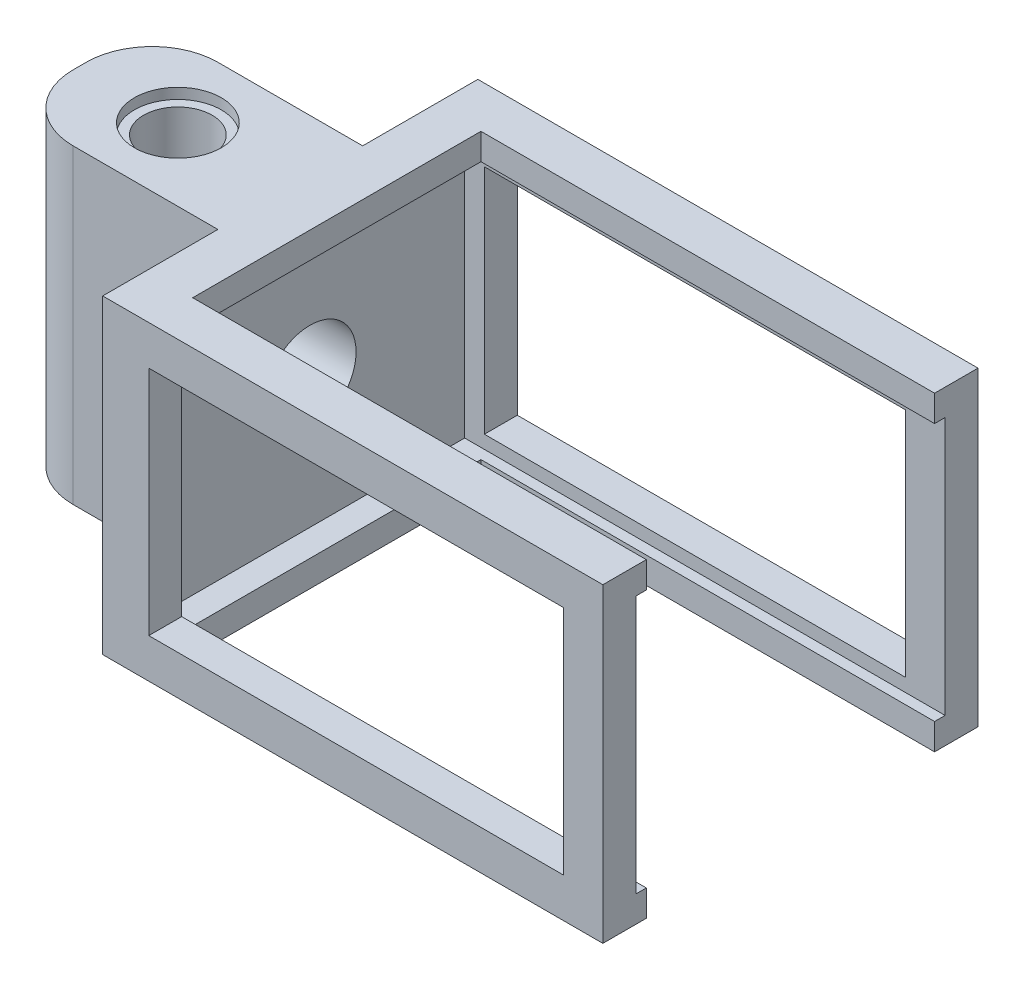
ISO-10303-21;
HEADER;
FILE_DESCRIPTION(('STEP AP214'),'2;1');
FILE_NAME('part.step','',(''),(''),'','','');
FILE_SCHEMA(('AUTOMOTIVE_DESIGN { 1 0 10303 214 1 1 1 1 }'));
ENDSEC;
DATA;
#1=APPLICATION_CONTEXT('core data for automotive mechanical design processes');
#2=APPLICATION_PROTOCOL_DEFINITION('international standard','automotive_design',2000,#1);
#3=PRODUCT_CONTEXT('',#1,'mechanical');
#4=PRODUCT('Part','Part','',(#3));
#5=PRODUCT_RELATED_PRODUCT_CATEGORY('part','',(#4));
#6=PRODUCT_DEFINITION_FORMATION('','',#4);
#7=PRODUCT_DEFINITION_CONTEXT('part definition',#1,'design');
#8=PRODUCT_DEFINITION('design','',#6,#7);
#9=PRODUCT_DEFINITION_SHAPE('','',#8);
#10=(LENGTH_UNIT() NAMED_UNIT(*) SI_UNIT(.MILLI.,.METRE.));
#11=(NAMED_UNIT(*) PLANE_ANGLE_UNIT() SI_UNIT($,.RADIAN.));
#12=(NAMED_UNIT(*) SI_UNIT($,.STERADIAN.) SOLID_ANGLE_UNIT());
#13=UNCERTAINTY_MEASURE_WITH_UNIT(LENGTH_MEASURE(1.E-05),#10,'distance_accuracy_value','');
#14=(GEOMETRIC_REPRESENTATION_CONTEXT(3) GLOBAL_UNCERTAINTY_ASSIGNED_CONTEXT((#13)) GLOBAL_UNIT_ASSIGNED_CONTEXT((#10,
#11,#12)) REPRESENTATION_CONTEXT('',''));
#15=CARTESIAN_POINT('',(0.,0.,0.));
#16=DIRECTION('',(0.,0.,1.));
#17=DIRECTION('',(1.,0.,0.));
#18=AXIS2_PLACEMENT_3D('',#15,#16,#17);
#19=CARTESIAN_POINT('',(0.,0.,2.5));
#20=DIRECTION('',(0.,0.,-1.));
#21=DIRECTION('',(-1.,0.,0.));
#22=AXIS2_PLACEMENT_3D('',#19,#20,#21);
#23=PLANE('',#22);
#24=DIRECTION('',(-1.,0.,0.));
#25=VECTOR('',#24,1.);
#26=CARTESIAN_POINT('',(38.,20.6,2.5));
#27=LINE('',#26,#25);
#28=CARTESIAN_POINT('',(35.,20.6,2.5));
#29=VERTEX_POINT('',#28);
#30=CARTESIAN_POINT('',(3.,20.6,2.5));
#31=VERTEX_POINT('',#30);
#32=EDGE_CURVE('E416',#29,#31,#27,.T.);
#33=ORIENTED_EDGE('',*,*,#32,.F.);
#34=DIRECTION('',(0.,-1.,0.));
#35=VECTOR('',#34,1.);
#36=CARTESIAN_POINT('',(35.,23.,2.5));
#37=LINE('',#36,#35);
#38=CARTESIAN_POINT('',(35.,3.,2.5));
#39=VERTEX_POINT('',#38);
#40=EDGE_CURVE('E353',#29,#39,#37,.T.);
#41=ORIENTED_EDGE('',*,*,#40,.T.);
#42=DIRECTION('',(1.,0.,0.));
#43=VECTOR('',#42,1.);
#44=CARTESIAN_POINT('',(38.,3.,2.5));
#45=LINE('',#44,#43);
#46=CARTESIAN_POINT('',(3.,3.,2.5));
#47=VERTEX_POINT('',#46);
#48=EDGE_CURVE('E420',#47,#39,#45,.T.);
#49=ORIENTED_EDGE('',*,*,#48,.F.);
#50=DIRECTION('',(0.,-1.,0.));
#51=VECTOR('',#50,1.);
#52=CARTESIAN_POINT('',(3.,20.6,2.5));
#53=LINE('',#52,#51);
#54=EDGE_CURVE('E428',#31,#47,#53,.T.);
#55=ORIENTED_EDGE('',*,*,#54,.F.);
#56=EDGE_LOOP('',(#33,#41,#49,#55));
#57=FACE_BOUND('',#56,.T.);
#58=DIRECTION('',(-1.,0.,0.));
#59=VECTOR('',#58,1.);
#60=CARTESIAN_POINT('',(0.,2.,2.5));
#61=LINE('',#60,#59);
#62=CARTESIAN_POINT('',(38.,2.,2.5));
#63=VERTEX_POINT('',#62);
#64=CARTESIAN_POINT('',(1.5,2.,2.5));
#65=VERTEX_POINT('',#64);
#66=EDGE_CURVE('E52',#63,#65,#61,.T.);
#67=ORIENTED_EDGE('',*,*,#66,.F.);
#68=DIRECTION('',(0.,1.,0.));
#69=VECTOR('',#68,1.);
#70=CARTESIAN_POINT('',(38.,0.,2.5));
#71=LINE('',#70,#69);
#72=CARTESIAN_POINT('',(38.,21.6,2.5));
#73=VERTEX_POINT('',#72);
#74=EDGE_CURVE('E437',#63,#73,#71,.T.);
#75=ORIENTED_EDGE('',*,*,#74,.T.);
#76=DIRECTION('',(1.,0.,0.));
#77=VECTOR('',#76,1.);
#78=CARTESIAN_POINT('',(0.,21.6,2.5));
#79=LINE('',#78,#77);
#80=CARTESIAN_POINT('',(1.5,21.6,2.5));
#81=VERTEX_POINT('',#80);
#82=EDGE_CURVE('E397',#81,#73,#79,.T.);
#83=ORIENTED_EDGE('',*,*,#82,.F.);
#84=DIRECTION('',(0.,1.,0.));
#85=VECTOR('',#84,1.);
#86=CARTESIAN_POINT('',(1.5,0.,2.5));
#87=LINE('',#86,#85);
#88=EDGE_CURVE('E407',#65,#81,#87,.T.);
#89=ORIENTED_EDGE('',*,*,#88,.F.);
#90=EDGE_LOOP('',(#67,#75,#83,#89));
#91=FACE_BOUND('',#90,.T.);
#92=ADVANCED_FACE('F37',(#57,#91),#23,.F.);
#93=CARTESIAN_POINT('',(3.53721509060322,-6.4,0.));
#94=DIRECTION('',(-1.,0.,0.));
#95=DIRECTION('',(0.,0.,1.));
#96=AXIS2_PLACEMENT_3D('',#93,#94,#95);
#97=PLANE('',#96);
#98=DIRECTION('',(0.,-1.,0.));
#99=VECTOR('',#98,1.);
#100=CARTESIAN_POINT('',(3.53721509060322,0.,3.3));
#101=LINE('',#100,#99);
#102=CARTESIAN_POINT('',(3.53721509060322,2.,3.3));
#103=VERTEX_POINT('',#102);
#104=CARTESIAN_POINT('',(3.53721509060322,0.,3.3));
#105=VERTEX_POINT('',#104);
#106=EDGE_CURVE('E60',#103,#105,#101,.T.);
#107=ORIENTED_EDGE('',*,*,#106,.F.);
#108=DIRECTION('',(0.,0.,-1.));
#109=VECTOR('',#108,1.);
#110=CARTESIAN_POINT('',(3.53721509060322,2.,28.5));
#111=LINE('',#110,#109);
#112=CARTESIAN_POINT('',(3.53721509060322,2.,25.2));
#113=VERTEX_POINT('',#112);
#114=EDGE_CURVE('E240',#113,#103,#111,.T.);
#115=ORIENTED_EDGE('',*,*,#114,.F.);
#116=DIRECTION('',(0.,1.,0.));
#117=VECTOR('',#116,1.);
#118=CARTESIAN_POINT('',(3.53721509060322,0.,25.2));
#119=LINE('',#118,#117);
#120=CARTESIAN_POINT('',(3.53721509060322,0.,25.2));
#121=VERTEX_POINT('',#120);
#122=EDGE_CURVE('E236',#121,#113,#119,.T.);
#123=ORIENTED_EDGE('',*,*,#122,.F.);
#124=DIRECTION('',(0.,0.,1.));
#125=VECTOR('',#124,1.);
#126=CARTESIAN_POINT('',(3.53721509060322,0.,2.5));
#127=LINE('',#126,#125);
#128=EDGE_CURVE('E232',#105,#121,#127,.T.);
#129=ORIENTED_EDGE('',*,*,#128,.F.);
#130=EDGE_LOOP('',(#107,#115,#123,#129));
#131=FACE_BOUND('',#130,.T.);
#132=ADVANCED_FACE('F234',(#131),#97,.F.);
#133=CARTESIAN_POINT('',(38.,3.,26.));
#134=DIRECTION('',(0.,0.,1.));
#135=DIRECTION('',(1.,0.,0.));
#136=AXIS2_PLACEMENT_3D('',#133,#134,#135);
#137=PLANE('',#136);
#138=DIRECTION('',(0.,-1.,0.));
#139=VECTOR('',#138,1.);
#140=CARTESIAN_POINT('',(35.,23.,26.));
#141=LINE('',#140,#139);
#142=CARTESIAN_POINT('',(35.,20.6,26.));
#143=VERTEX_POINT('',#142);
#144=CARTESIAN_POINT('',(35.,3.,26.));
#145=VERTEX_POINT('',#144);
#146=EDGE_CURVE('E347',#143,#145,#141,.T.);
#147=ORIENTED_EDGE('',*,*,#146,.F.);
#148=DIRECTION('',(1.,0.,0.));
#149=VECTOR('',#148,1.);
#150=CARTESIAN_POINT('',(0.,20.6,26.));
#151=LINE('',#150,#149);
#152=CARTESIAN_POINT('',(3.5,20.6,26.));
#153=VERTEX_POINT('',#152);
#154=EDGE_CURVE('E378',#153,#143,#151,.T.);
#155=ORIENTED_EDGE('',*,*,#154,.F.);
#156=DIRECTION('',(0.,1.,0.));
#157=VECTOR('',#156,1.);
#158=CARTESIAN_POINT('',(3.5,3.,26.));
#159=LINE('',#158,#157);
#160=CARTESIAN_POINT('',(3.5,3.,26.));
#161=VERTEX_POINT('',#160);
#162=EDGE_CURVE('E363',#161,#153,#159,.T.);
#163=ORIENTED_EDGE('',*,*,#162,.F.);
#164=DIRECTION('',(-1.,0.,0.));
#165=VECTOR('',#164,1.);
#166=CARTESIAN_POINT('',(38.,3.,26.));
#167=LINE('',#166,#165);
#168=EDGE_CURVE('E382',#145,#161,#167,.T.);
#169=ORIENTED_EDGE('',*,*,#168,.F.);
#170=EDGE_LOOP('',(#147,#155,#163,#169));
#171=FACE_BOUND('',#170,.T.);
#172=DIRECTION('',(0.,-1.,0.));
#173=VECTOR('',#172,1.);
#174=CARTESIAN_POINT('',(38.,3.,26.));
#175=LINE('',#174,#173);
#176=CARTESIAN_POINT('',(38.,21.6,26.));
#177=VERTEX_POINT('',#176);
#178=CARTESIAN_POINT('',(38.,2.,26.));
#179=VERTEX_POINT('',#178);
#180=EDGE_CURVE('E390',#177,#179,#175,.T.);
#181=ORIENTED_EDGE('',*,*,#180,.T.);
#182=DIRECTION('',(-1.,0.,0.));
#183=VECTOR('',#182,1.);
#184=CARTESIAN_POINT('',(38.,2.,26.));
#185=LINE('',#184,#183);
#186=CARTESIAN_POINT('',(1.5,2.,26.));
#187=VERTEX_POINT('',#186);
#188=EDGE_CURVE('E380',#179,#187,#185,.T.);
#189=ORIENTED_EDGE('',*,*,#188,.T.);
#190=DIRECTION('',(0.,-1.,0.));
#191=VECTOR('',#190,1.);
#192=CARTESIAN_POINT('',(1.5,3.,26.));
#193=LINE('',#192,#191);
#194=CARTESIAN_POINT('',(1.5,21.6,26.));
#195=VERTEX_POINT('',#194);
#196=EDGE_CURVE('E386',#195,#187,#193,.T.);
#197=ORIENTED_EDGE('',*,*,#196,.F.);
#198=DIRECTION('',(1.,0.,0.));
#199=VECTOR('',#198,1.);
#200=CARTESIAN_POINT('',(0.,21.6,26.));
#201=LINE('',#200,#199);
#202=EDGE_CURVE('E375',#195,#177,#201,.T.);
#203=ORIENTED_EDGE('',*,*,#202,.T.);
#204=EDGE_LOOP('',(#181,#189,#197,#203));
#205=FACE_BOUND('',#204,.T.);
#206=ADVANCED_FACE('F569',(#171,#205),#137,.F.);
#207=DIRECTION('',(0.,-1.,0.));
#208=VECTOR('',#207,1.);
#209=CARTESIAN_POINT('',(3.53721509060322,21.6,3.3));
#210=LINE('',#209,#208);
#211=CARTESIAN_POINT('',(3.53721509060322,23.6,3.3));
#212=VERTEX_POINT('',#211);
#213=CARTESIAN_POINT('',(3.53721509060322,21.6,3.3));
#214=VERTEX_POINT('',#213);
#215=EDGE_CURVE('E280',#212,#214,#210,.T.);
#216=ORIENTED_EDGE('',*,*,#215,.F.);
#217=DIRECTION('',(0.,0.,1.));
#218=VECTOR('',#217,1.);
#219=CARTESIAN_POINT('',(3.53721509060322,23.6,0.));
#220=LINE('',#219,#218);
#221=CARTESIAN_POINT('',(3.53721509060322,23.6,25.2));
#222=VERTEX_POINT('',#221);
#223=EDGE_CURVE('E241',#212,#222,#220,.T.);
#224=ORIENTED_EDGE('',*,*,#223,.T.);
#225=DIRECTION('',(0.,1.,0.));
#226=VECTOR('',#225,1.);
#227=CARTESIAN_POINT('',(3.53721509060322,21.6,25.2));
#228=LINE('',#227,#226);
#229=CARTESIAN_POINT('',(3.53721509060322,21.6,25.2));
#230=VERTEX_POINT('',#229);
#231=EDGE_CURVE('E294',#230,#222,#228,.T.);
#232=ORIENTED_EDGE('',*,*,#231,.F.);
#233=DIRECTION('',(0.,0.,1.));
#234=VECTOR('',#233,1.);
#235=CARTESIAN_POINT('',(3.53721509060322,21.6,28.5));
#236=LINE('',#235,#234);
#237=EDGE_CURVE('E361',#214,#230,#236,.T.);
#238=ORIENTED_EDGE('',*,*,#237,.F.);
#239=EDGE_LOOP('',(#216,#224,#232,#238));
#240=FACE_BOUND('',#239,.T.);
#241=ADVANCED_FACE('F527',(#240),#97,.F.);
#242=CARTESIAN_POINT('',(-8.54,-6.4,14.2500000000002));
#243=DIRECTION('',(0.,1.,0.));
#244=DIRECTION('',(0.,0.,1.));
#245=AXIS2_PLACEMENT_3D('',#242,#243,#244);
#246=CYLINDRICAL_SURFACE('',#245,2.6);
#247=CARTESIAN_POINT('',(-8.54,22.8,14.2500000000002));
#248=DIRECTION('',(0.,1.,0.));
#249=DIRECTION('',(0.,0.,1.));
#250=AXIS2_PLACEMENT_3D('',#247,#248,#249);
#251=CIRCLE('',#250,2.6);
#252=CARTESIAN_POINT('',(-8.54,22.8,16.8500000000002));
#253=VERTEX_POINT('',#252);
#254=EDGE_CURVE('E318',#253,#253,#251,.F.);
#255=ORIENTED_EDGE('',*,*,#254,.F.);
#256=EDGE_LOOP('',(#255));
#257=FACE_BOUND('',#256,.T.);
#258=CARTESIAN_POINT('',(-8.54,0.8,14.2500000000002));
#259=DIRECTION('',(0.,-1.,0.));
#260=DIRECTION('',(0.,0.,-1.));
#261=AXIS2_PLACEMENT_3D('',#258,#259,#260);
#262=CIRCLE('',#261,2.6);
#263=CARTESIAN_POINT('',(-8.54,0.8,11.6500000000002));
#264=VERTEX_POINT('',#263);
#265=EDGE_CURVE('E312',#264,#264,#262,.F.);
#266=ORIENTED_EDGE('',*,*,#265,.F.);
#267=EDGE_LOOP('',(#266));
#268=FACE_BOUND('',#267,.T.);
#269=ADVANCED_FACE('F614',(#257,#268),#246,.F.);
#270=CARTESIAN_POINT('',(0.,0.,2.5));
#271=DIRECTION('',(1.,0.,0.));
#272=DIRECTION('',(0.,0.,-1.));
#273=AXIS2_PLACEMENT_3D('',#270,#271,#272);
#274=PLANE('',#273);
#275=DIRECTION('',(0.,-1.,0.));
#276=VECTOR('',#275,1.);
#277=CARTESIAN_POINT('',(0.,0.,8.75));
#278=LINE('',#277,#276);
#279=CARTESIAN_POINT('',(0.,23.6,8.75));
#280=VERTEX_POINT('',#279);
#281=CARTESIAN_POINT('',(0.,0.,8.75));
#282=VERTEX_POINT('',#281);
#283=EDGE_CURVE('E325',#280,#282,#278,.T.);
#284=ORIENTED_EDGE('',*,*,#283,.F.);
#285=DIRECTION('',(0.,0.,-1.));
#286=VECTOR('',#285,1.);
#287=CARTESIAN_POINT('',(0.,23.6,2.5));
#288=LINE('',#287,#286);
#289=CARTESIAN_POINT('',(0.,23.6,0.));
#290=VERTEX_POINT('',#289);
#291=EDGE_CURVE('E439',#280,#290,#288,.T.);
#292=ORIENTED_EDGE('',*,*,#291,.T.);
#293=DIRECTION('',(0.,-1.,0.));
#294=VECTOR('',#293,1.);
#295=CARTESIAN_POINT('',(0.,0.,0.));
#296=LINE('',#295,#294);
#297=CARTESIAN_POINT('',(0.,0.,0.));
#298=VERTEX_POINT('',#297);
#299=EDGE_CURVE('E434',#290,#298,#296,.T.);
#300=ORIENTED_EDGE('',*,*,#299,.T.);
#301=DIRECTION('',(0.,0.,-1.));
#302=VECTOR('',#301,1.);
#303=CARTESIAN_POINT('',(0.,0.,2.5));
#304=LINE('',#303,#302);
#305=EDGE_CURVE('E457',#282,#298,#304,.T.);
#306=ORIENTED_EDGE('',*,*,#305,.F.);
#307=EDGE_LOOP('',(#284,#292,#300,#306));
#308=FACE_BOUND('',#307,.T.);
#309=ADVANCED_FACE('F546',(#308),#274,.F.);
#310=CARTESIAN_POINT('',(0.,3.,0.));
#311=DIRECTION('',(0.,1.,0.));
#312=DIRECTION('',(-1.,0.,0.));
#313=AXIS2_PLACEMENT_3D('',#310,#311,#312);
#314=PLANE('',#313);
#315=DIRECTION('',(1.,0.,0.));
#316=VECTOR('',#315,1.);
#317=CARTESIAN_POINT('',(38.,3.,28.5));
#318=LINE('',#317,#316);
#319=CARTESIAN_POINT('',(3.5,3.,28.5));
#320=VERTEX_POINT('',#319);
#321=CARTESIAN_POINT('',(35.,3.,28.5));
#322=VERTEX_POINT('',#321);
#323=EDGE_CURVE('E384',#320,#322,#318,.T.);
#324=ORIENTED_EDGE('',*,*,#323,.T.);
#325=DIRECTION('',(0.,0.,1.));
#326=VECTOR('',#325,1.);
#327=CARTESIAN_POINT('',(35.,3.,28.5));
#328=LINE('',#327,#326);
#329=EDGE_CURVE('E341',#145,#322,#328,.T.);
#330=ORIENTED_EDGE('',*,*,#329,.F.);
#331=ORIENTED_EDGE('',*,*,#168,.T.);
#332=DIRECTION('',(0.,0.,-1.));
#333=VECTOR('',#332,1.);
#334=CARTESIAN_POINT('',(3.5,3.,26.));
#335=LINE('',#334,#333);
#336=EDGE_CURVE('E372',#320,#161,#335,.T.);
#337=ORIENTED_EDGE('',*,*,#336,.F.);
#338=EDGE_LOOP('',(#324,#330,#331,#337));
#339=FACE_BOUND('',#338,.T.);
#340=ADVANCED_FACE('F621',(#339),#314,.T.);
#341=CARTESIAN_POINT('',(0.,20.6,0.));
#342=DIRECTION('',(0.,-1.,0.));
#343=DIRECTION('',(0.,0.,-1.));
#344=AXIS2_PLACEMENT_3D('',#341,#342,#343);
#345=PLANE('',#344);
#346=ORIENTED_EDGE('',*,*,#154,.T.);
#347=DIRECTION('',(0.,0.,1.));
#348=VECTOR('',#347,1.);
#349=CARTESIAN_POINT('',(35.,20.6,0.));
#350=LINE('',#349,#348);
#351=CARTESIAN_POINT('',(35.,20.6,28.5));
#352=VERTEX_POINT('',#351);
#353=EDGE_CURVE('E464',#143,#352,#350,.T.);
#354=ORIENTED_EDGE('',*,*,#353,.T.);
#355=DIRECTION('',(-1.,0.,0.));
#356=VECTOR('',#355,1.);
#357=CARTESIAN_POINT('',(0.,20.6,28.5));
#358=LINE('',#357,#356);
#359=CARTESIAN_POINT('',(3.5,20.6,28.5));
#360=VERTEX_POINT('',#359);
#361=EDGE_CURVE('E376',#352,#360,#358,.T.);
#362=ORIENTED_EDGE('',*,*,#361,.T.);
#363=DIRECTION('',(0.,0.,1.));
#364=VECTOR('',#363,1.);
#365=CARTESIAN_POINT('',(3.5,20.6,26.));
#366=LINE('',#365,#364);
#367=EDGE_CURVE('E366',#153,#360,#366,.T.);
#368=ORIENTED_EDGE('',*,*,#367,.F.);
#369=EDGE_LOOP('',(#346,#354,#362,#368));
#370=FACE_BOUND('',#369,.T.);
#371=ADVANCED_FACE('F640',(#370),#345,.T.);
#372=CARTESIAN_POINT('',(38.,3.,0.));
#373=DIRECTION('',(0.,-1.,0.));
#374=DIRECTION('',(0.,0.,-1.));
#375=AXIS2_PLACEMENT_3D('',#372,#373,#374);
#376=PLANE('',#375);
#377=DIRECTION('',(0.,0.,1.));
#378=VECTOR('',#377,1.);
#379=CARTESIAN_POINT('',(35.,3.,2.5));
#380=LINE('',#379,#378);
#381=CARTESIAN_POINT('',(35.,3.,0.));
#382=VERTEX_POINT('',#381);
#383=EDGE_CURVE('E350',#382,#39,#380,.T.);
#384=ORIENTED_EDGE('',*,*,#383,.F.);
#385=DIRECTION('',(1.,0.,0.));
#386=VECTOR('',#385,1.);
#387=CARTESIAN_POINT('',(38.,3.,0.));
#388=LINE('',#387,#386);
#389=CARTESIAN_POINT('',(3.,3.,0.));
#390=VERTEX_POINT('',#389);
#391=EDGE_CURVE('E423',#390,#382,#388,.T.);
#392=ORIENTED_EDGE('',*,*,#391,.F.);
#393=DIRECTION('',(0.,0.,1.));
#394=VECTOR('',#393,1.);
#395=CARTESIAN_POINT('',(3.,3.,0.));
#396=LINE('',#395,#394);
#397=EDGE_CURVE('E432',#390,#47,#396,.T.);
#398=ORIENTED_EDGE('',*,*,#397,.T.);
#399=ORIENTED_EDGE('',*,*,#48,.T.);
#400=EDGE_LOOP('',(#384,#392,#398,#399));
#401=FACE_BOUND('',#400,.T.);
#402=ADVANCED_FACE('F643',(#401),#376,.F.);
#403=CARTESIAN_POINT('',(38.,20.6,0.));
#404=DIRECTION('',(0.,1.,0.));
#405=DIRECTION('',(0.,0.,1.));
#406=AXIS2_PLACEMENT_3D('',#403,#404,#405);
#407=PLANE('',#406);
#408=DIRECTION('',(0.,0.,-1.));
#409=VECTOR('',#408,1.);
#410=CARTESIAN_POINT('',(35.,20.6,0.));
#411=LINE('',#410,#409);
#412=CARTESIAN_POINT('',(35.,20.6,0.));
#413=VERTEX_POINT('',#412);
#414=EDGE_CURVE('E461',#29,#413,#411,.T.);
#415=ORIENTED_EDGE('',*,*,#414,.F.);
#416=ORIENTED_EDGE('',*,*,#32,.T.);
#417=DIRECTION('',(0.,0.,1.));
#418=VECTOR('',#417,1.);
#419=CARTESIAN_POINT('',(3.,20.6,0.));
#420=LINE('',#419,#418);
#421=CARTESIAN_POINT('',(3.,20.6,0.));
#422=VERTEX_POINT('',#421);
#423=EDGE_CURVE('E426',#422,#31,#420,.T.);
#424=ORIENTED_EDGE('',*,*,#423,.F.);
#425=DIRECTION('',(-1.,0.,0.));
#426=VECTOR('',#425,1.);
#427=CARTESIAN_POINT('',(38.,20.6,0.));
#428=LINE('',#427,#426);
#429=EDGE_CURVE('E417',#413,#422,#428,.T.);
#430=ORIENTED_EDGE('',*,*,#429,.F.);
#431=EDGE_LOOP('',(#415,#416,#424,#430));
#432=FACE_BOUND('',#431,.T.);
#433=ADVANCED_FACE('F573',(#432),#407,.F.);
#434=CARTESIAN_POINT('',(38.,0.,2.5));
#435=DIRECTION('',(-1.,0.,0.));
#436=DIRECTION('',(0.,0.,1.));
#437=AXIS2_PLACEMENT_3D('',#434,#435,#436);
#438=PLANE('',#437);
#439=DIRECTION('',(0.,0.,-1.));
#440=VECTOR('',#439,1.);
#441=CARTESIAN_POINT('',(38.,23.6,2.5));
#442=LINE('',#441,#440);
#443=CARTESIAN_POINT('',(38.,23.6,28.5));
#444=VERTEX_POINT('',#443);
#445=CARTESIAN_POINT('',(38.,23.6,25.2));
#446=VERTEX_POINT('',#445);
#447=EDGE_CURVE('E453',#444,#446,#442,.T.);
#448=ORIENTED_EDGE('',*,*,#447,.F.);
#449=DIRECTION('',(0.,1.,0.));
#450=VECTOR('',#449,1.);
#451=CARTESIAN_POINT('',(38.,0.,28.5));
#452=LINE('',#451,#450);
#453=CARTESIAN_POINT('',(38.,0.,28.5));
#454=VERTEX_POINT('',#453);
#455=EDGE_CURVE('E403',#454,#444,#452,.T.);
#456=ORIENTED_EDGE('',*,*,#455,.F.);
#457=DIRECTION('',(0.,0.,-1.));
#458=VECTOR('',#457,1.);
#459=CARTESIAN_POINT('',(38.,0.,2.5));
#460=LINE('',#459,#458);
#461=CARTESIAN_POINT('',(38.,0.,25.2));
#462=VERTEX_POINT('',#461);
#463=EDGE_CURVE('E455',#454,#462,#460,.T.);
#464=ORIENTED_EDGE('',*,*,#463,.T.);
#465=DIRECTION('',(0.,-1.,0.));
#466=VECTOR('',#465,1.);
#467=CARTESIAN_POINT('',(38.,0.,25.2));
#468=LINE('',#467,#466);
#469=CARTESIAN_POINT('',(38.,2.,25.2));
#470=VERTEX_POINT('',#469);
#471=EDGE_CURVE('E272',#470,#462,#468,.T.);
#472=ORIENTED_EDGE('',*,*,#471,.F.);
#473=DIRECTION('',(0.,0.,1.));
#474=VECTOR('',#473,1.);
#475=CARTESIAN_POINT('',(38.,2.,25.2));
#476=LINE('',#475,#474);
#477=EDGE_CURVE('E277',#470,#179,#476,.T.);
#478=ORIENTED_EDGE('',*,*,#477,.T.);
#479=ORIENTED_EDGE('',*,*,#180,.F.);
#480=DIRECTION('',(0.,0.,1.));
#481=VECTOR('',#480,1.);
#482=CARTESIAN_POINT('',(38.,21.6,25.2));
#483=LINE('',#482,#481);
#484=CARTESIAN_POINT('',(38.,21.6,25.2));
#485=VERTEX_POINT('',#484);
#486=EDGE_CURVE('E305',#485,#177,#483,.T.);
#487=ORIENTED_EDGE('',*,*,#486,.F.);
#488=DIRECTION('',(0.,-1.,0.));
#489=VECTOR('',#488,1.);
#490=CARTESIAN_POINT('',(38.,21.6,25.2));
#491=LINE('',#490,#489);
#492=EDGE_CURVE('E300',#446,#485,#491,.T.);
#493=ORIENTED_EDGE('',*,*,#492,.F.);
#494=EDGE_LOOP('',(#448,#456,#464,#472,#478,#479,#487,#493));
#495=FACE_BOUND('',#494,.T.);
#496=ADVANCED_FACE('F519',(#495),#438,.F.);
#497=CARTESIAN_POINT('',(1.5,0.,28.5));
#498=DIRECTION('',(-1.,0.,0.));
#499=DIRECTION('',(0.,0.,1.));
#500=AXIS2_PLACEMENT_3D('',#497,#498,#499);
#501=PLANE('',#500);
#502=CARTESIAN_POINT('',(1.5,11.8,14.25));
#503=DIRECTION('',(1.,0.,0.));
#504=DIRECTION('',(0.,0.,-1.));
#505=AXIS2_PLACEMENT_3D('',#502,#503,#504);
#506=CIRCLE('',#505,3.5);
#507=CARTESIAN_POINT('',(1.5,11.8,10.75));
#508=VERTEX_POINT('',#507);
#509=EDGE_CURVE('E260',#508,#508,#506,.T.);
#510=ORIENTED_EDGE('',*,*,#509,.F.);
#511=EDGE_LOOP('',(#510));
#512=FACE_BOUND('',#511,.T.);
#513=DIRECTION('',(0.,0.,-1.));
#514=VECTOR('',#513,1.);
#515=CARTESIAN_POINT('',(1.5,21.6,28.5));
#516=LINE('',#515,#514);
#517=EDGE_CURVE('E405',#195,#81,#516,.T.);
#518=ORIENTED_EDGE('',*,*,#517,.F.);
#519=ORIENTED_EDGE('',*,*,#196,.T.);
#520=DIRECTION('',(0.,0.,-1.));
#521=VECTOR('',#520,1.);
#522=CARTESIAN_POINT('',(1.5,2.,28.5));
#523=LINE('',#522,#521);
#524=EDGE_CURVE('E413',#187,#65,#523,.T.);
#525=ORIENTED_EDGE('',*,*,#524,.T.);
#526=ORIENTED_EDGE('',*,*,#88,.T.);
#527=EDGE_LOOP('',(#518,#519,#525,#526));
#528=FACE_BOUND('',#527,.T.);
#529=ADVANCED_FACE('F653',(#512,#528),#501,.F.);
#530=CARTESIAN_POINT('',(0.,21.6,28.5));
#531=DIRECTION('',(0.,1.,0.));
#532=DIRECTION('',(0.,0.,1.));
#533=AXIS2_PLACEMENT_3D('',#530,#531,#532);
#534=PLANE('',#533);
#535=ORIENTED_EDGE('',*,*,#82,.T.);
#536=DIRECTION('',(0.,0.,-1.));
#537=VECTOR('',#536,1.);
#538=CARTESIAN_POINT('',(38.,21.6,3.3));
#539=LINE('',#538,#537);
#540=CARTESIAN_POINT('',(38.,21.6,3.3));
#541=VERTEX_POINT('',#540);
#542=EDGE_CURVE('E291',#541,#73,#539,.T.);
#543=ORIENTED_EDGE('',*,*,#542,.F.);
#544=DIRECTION('',(1.,0.,0.));
#545=VECTOR('',#544,1.);
#546=CARTESIAN_POINT('',(3.53721509060322,21.6,3.3));
#547=LINE('',#546,#545);
#548=EDGE_CURVE('E283',#214,#541,#547,.T.);
#549=ORIENTED_EDGE('',*,*,#548,.F.);
#550=ORIENTED_EDGE('',*,*,#237,.T.);
#551=DIRECTION('',(-1.,0.,0.));
#552=VECTOR('',#551,1.);
#553=CARTESIAN_POINT('',(3.53721509060322,21.6,25.2));
#554=LINE('',#553,#552);
#555=EDGE_CURVE('E302',#485,#230,#554,.T.);
#556=ORIENTED_EDGE('',*,*,#555,.F.);
#557=ORIENTED_EDGE('',*,*,#486,.T.);
#558=ORIENTED_EDGE('',*,*,#202,.F.);
#559=ORIENTED_EDGE('',*,*,#517,.T.);
#560=EDGE_LOOP('',(#535,#543,#549,#550,#556,#557,#558,#559));
#561=FACE_BOUND('',#560,.T.);
#562=ADVANCED_FACE('F524',(#561),#534,.F.);
#563=CARTESIAN_POINT('',(0.,2.,28.5));
#564=DIRECTION('',(0.,-1.,0.));
#565=DIRECTION('',(1.,0.,0.));
#566=AXIS2_PLACEMENT_3D('',#563,#564,#565);
#567=PLANE('',#566);
#568=ORIENTED_EDGE('',*,*,#188,.F.);
#569=ORIENTED_EDGE('',*,*,#477,.F.);
#570=DIRECTION('',(1.,0.,0.));
#571=VECTOR('',#570,1.);
#572=CARTESIAN_POINT('',(3.53721509060322,2.,25.2));
#573=LINE('',#572,#571);
#574=EDGE_CURVE('E270',#113,#470,#573,.T.);
#575=ORIENTED_EDGE('',*,*,#574,.F.);
#576=ORIENTED_EDGE('',*,*,#114,.T.);
#577=DIRECTION('',(-1.,0.,0.));
#578=VECTOR('',#577,1.);
#579=CARTESIAN_POINT('',(3.53721509060322,2.,3.3));
#580=LINE('',#579,#578);
#581=CARTESIAN_POINT('',(38.,2.,3.3));
#582=VERTEX_POINT('',#581);
#583=EDGE_CURVE('E256',#582,#103,#580,.T.);
#584=ORIENTED_EDGE('',*,*,#583,.F.);
#585=DIRECTION('',(0.,0.,-1.));
#586=VECTOR('',#585,1.);
#587=CARTESIAN_POINT('',(38.,2.,3.3));
#588=LINE('',#587,#586);
#589=EDGE_CURVE('E266',#582,#63,#588,.T.);
#590=ORIENTED_EDGE('',*,*,#589,.T.);
#591=ORIENTED_EDGE('',*,*,#66,.T.);
#592=ORIENTED_EDGE('',*,*,#524,.F.);
#593=EDGE_LOOP('',(#568,#569,#575,#576,#584,#590,#591,#592));
#594=FACE_BOUND('',#593,.T.);
#595=ADVANCED_FACE('F588',(#594),#567,.F.);
#596=CARTESIAN_POINT('',(0.,23.6,28.5));
#597=VERTEX_POINT('',#596);
#598=CARTESIAN_POINT('',(0.,23.6,19.75));
#599=VERTEX_POINT('',#598);
#600=EDGE_CURVE('E449',#597,#599,#288,.T.);
#601=ORIENTED_EDGE('',*,*,#600,.T.);
#602=DIRECTION('',(0.,-1.,0.));
#603=VECTOR('',#602,1.);
#604=CARTESIAN_POINT('',(0.,0.,19.75));
#605=LINE('',#604,#603);
#606=CARTESIAN_POINT('',(0.,0.,19.75));
#607=VERTEX_POINT('',#606);
#608=EDGE_CURVE('E329',#599,#607,#605,.T.);
#609=ORIENTED_EDGE('',*,*,#608,.T.);
#610=CARTESIAN_POINT('',(0.,0.,28.5));
#611=VERTEX_POINT('',#610);
#612=EDGE_CURVE('E458',#611,#607,#304,.T.);
#613=ORIENTED_EDGE('',*,*,#612,.F.);
#614=DIRECTION('',(0.,-1.,0.));
#615=VECTOR('',#614,1.);
#616=CARTESIAN_POINT('',(0.,0.,28.5));
#617=LINE('',#616,#615);
#618=EDGE_CURVE('E396',#597,#611,#617,.T.);
#619=ORIENTED_EDGE('',*,*,#618,.F.);
#620=EDGE_LOOP('',(#601,#609,#613,#619));
#621=FACE_BOUND('',#620,.T.);
#622=ADVANCED_FACE('F505',(#621),#274,.F.);
#623=CARTESIAN_POINT('',(0.,0.,2.5));
#624=DIRECTION('',(0.,1.,0.));
#625=DIRECTION('',(0.,0.,1.));
#626=AXIS2_PLACEMENT_3D('',#623,#624,#625);
#627=PLANE('',#626);
#628=CARTESIAN_POINT('',(-8.54,0.,14.2500000000002));
#629=DIRECTION('',(0.,-1.,0.));
#630=DIRECTION('',(0.,0.,-1.));
#631=AXIS2_PLACEMENT_3D('',#628,#629,#630);
#632=CIRCLE('',#631,3.3);
#633=CARTESIAN_POINT('',(-8.54,0.,10.9500000000002));
#634=VERTEX_POINT('',#633);
#635=EDGE_CURVE('E308',#634,#634,#632,.T.);
#636=ORIENTED_EDGE('',*,*,#635,.F.);
#637=EDGE_LOOP('',(#636));
#638=FACE_BOUND('',#637,.T.);
#639=DIRECTION('',(1.,0.,0.));
#640=VECTOR('',#639,1.);
#641=CARTESIAN_POINT('',(-16.,0.,19.75));
#642=LINE('',#641,#640);
#643=CARTESIAN_POINT('',(-11.,0.,19.75));
#644=VERTEX_POINT('',#643);
#645=EDGE_CURVE('E328',#644,#607,#642,.T.);
#646=ORIENTED_EDGE('',*,*,#645,.F.);
#647=CARTESIAN_POINT('',(-11.,0.,14.75));
#648=DIRECTION('',(0.,1.,0.));
#649=DIRECTION('',(0.,0.,1.));
#650=AXIS2_PLACEMENT_3D('',#647,#648,#649);
#651=CIRCLE('',#650,5.);
#652=CARTESIAN_POINT('',(-16.,0.,14.75));
#653=VERTEX_POINT('',#652);
#654=EDGE_CURVE('E484',#644,#653,#651,.F.);
#655=ORIENTED_EDGE('',*,*,#654,.T.);
#656=DIRECTION('',(0.,0.,1.));
#657=VECTOR('',#656,1.);
#658=CARTESIAN_POINT('',(-16.,0.,0.));
#659=LINE('',#658,#657);
#660=CARTESIAN_POINT('',(-16.,0.,13.75));
#661=VERTEX_POINT('',#660);
#662=EDGE_CURVE('E324',#661,#653,#659,.T.);
#663=ORIENTED_EDGE('',*,*,#662,.F.);
#664=CARTESIAN_POINT('',(-11.,0.,13.75));
#665=DIRECTION('',(0.,1.,0.));
#666=DIRECTION('',(0.,0.,1.));
#667=AXIS2_PLACEMENT_3D('',#664,#665,#666);
#668=CIRCLE('',#667,5.);
#669=CARTESIAN_POINT('',(-11.,0.,8.75));
#670=VERTEX_POINT('',#669);
#671=EDGE_CURVE('E474',#661,#670,#668,.F.);
#672=ORIENTED_EDGE('',*,*,#671,.T.);
#673=DIRECTION('',(1.,0.,0.));
#674=VECTOR('',#673,1.);
#675=CARTESIAN_POINT('',(-16.,0.,8.75));
#676=LINE('',#675,#674);
#677=EDGE_CURVE('E335',#670,#282,#676,.T.);
#678=ORIENTED_EDGE('',*,*,#677,.T.);
#679=ORIENTED_EDGE('',*,*,#305,.T.);
#680=DIRECTION('',(1.,0.,0.));
#681=VECTOR('',#680,1.);
#682=CARTESIAN_POINT('',(0.,0.,0.));
#683=LINE('',#682,#681);
#684=CARTESIAN_POINT('',(38.,0.,0.));
#685=VERTEX_POINT('',#684);
#686=EDGE_CURVE('E443',#298,#685,#683,.T.);
#687=ORIENTED_EDGE('',*,*,#686,.T.);
#688=CARTESIAN_POINT('',(38.,0.,3.3));
#689=VERTEX_POINT('',#688);
#690=EDGE_CURVE('E248',#689,#685,#460,.T.);
#691=ORIENTED_EDGE('',*,*,#690,.F.);
#692=DIRECTION('',(1.,0.,0.));
#693=VECTOR('',#692,1.);
#694=CARTESIAN_POINT('',(3.53721509060322,0.,3.3));
#695=LINE('',#694,#693);
#696=EDGE_CURVE('E244',#105,#689,#695,.T.);
#697=ORIENTED_EDGE('',*,*,#696,.F.);
#698=ORIENTED_EDGE('',*,*,#128,.T.);
#699=DIRECTION('',(-1.,0.,0.));
#700=VECTOR('',#699,1.);
#701=CARTESIAN_POINT('',(3.53721509060322,0.,25.2));
#702=LINE('',#701,#700);
#703=EDGE_CURVE('E275',#462,#121,#702,.T.);
#704=ORIENTED_EDGE('',*,*,#703,.F.);
#705=ORIENTED_EDGE('',*,*,#463,.F.);
#706=DIRECTION('',(1.,0.,0.));
#707=VECTOR('',#706,1.);
#708=CARTESIAN_POINT('',(0.,0.,28.5));
#709=LINE('',#708,#707);
#710=EDGE_CURVE('E400',#611,#454,#709,.T.);
#711=ORIENTED_EDGE('',*,*,#710,.F.);
#712=ORIENTED_EDGE('',*,*,#612,.T.);
#713=EDGE_LOOP('',(#646,#655,#663,#672,#678,#679,#687,#691,#697,#698,#704,#705,#711,#712));
#714=FACE_BOUND('',#713,.T.);
#715=ADVANCED_FACE('F246',(#638,#714),#627,.F.);
#716=CARTESIAN_POINT('',(38.,23.6,3.3));
#717=VERTEX_POINT('',#716);
#718=CARTESIAN_POINT('',(38.,23.6,0.));
#719=VERTEX_POINT('',#718);
#720=EDGE_CURVE('E452',#717,#719,#442,.T.);
#721=ORIENTED_EDGE('',*,*,#720,.F.);
#722=DIRECTION('',(0.,1.,0.));
#723=VECTOR('',#722,1.);
#724=CARTESIAN_POINT('',(38.,21.6,3.3));
#725=LINE('',#724,#723);
#726=EDGE_CURVE('E285',#541,#717,#725,.T.);
#727=ORIENTED_EDGE('',*,*,#726,.F.);
#728=ORIENTED_EDGE('',*,*,#542,.T.);
#729=ORIENTED_EDGE('',*,*,#74,.F.);
#730=ORIENTED_EDGE('',*,*,#589,.F.);
#731=DIRECTION('',(0.,1.,0.));
#732=VECTOR('',#731,1.);
#733=CARTESIAN_POINT('',(38.,0.,3.3));
#734=LINE('',#733,#732);
#735=EDGE_CURVE('E251',#689,#582,#734,.T.);
#736=ORIENTED_EDGE('',*,*,#735,.F.);
#737=ORIENTED_EDGE('',*,*,#690,.T.);
#738=DIRECTION('',(0.,1.,0.));
#739=VECTOR('',#738,1.);
#740=CARTESIAN_POINT('',(38.,0.,0.));
#741=LINE('',#740,#739);
#742=EDGE_CURVE('E445',#685,#719,#741,.T.);
#743=ORIENTED_EDGE('',*,*,#742,.T.);
#744=EDGE_LOOP('',(#721,#727,#728,#729,#730,#736,#737,#743));
#745=FACE_BOUND('',#744,.T.);
#746=ADVANCED_FACE('F535',(#745),#438,.F.);
#747=CARTESIAN_POINT('',(0.,23.6,2.5));
#748=DIRECTION('',(0.,-1.,0.));
#749=DIRECTION('',(0.,0.,-1.));
#750=AXIS2_PLACEMENT_3D('',#747,#748,#749);
#751=PLANE('',#750);
#752=CARTESIAN_POINT('',(-8.54,23.6,14.2500000000002));
#753=DIRECTION('',(0.,1.,0.));
#754=DIRECTION('',(0.,0.,1.));
#755=AXIS2_PLACEMENT_3D('',#752,#753,#754);
#756=CIRCLE('',#755,3.3);
#757=CARTESIAN_POINT('',(-8.54,23.6,17.5500000000002));
#758=VERTEX_POINT('',#757);
#759=EDGE_CURVE('E319',#758,#758,#756,.T.);
#760=ORIENTED_EDGE('',*,*,#759,.F.);
#761=EDGE_LOOP('',(#760));
#762=FACE_BOUND('',#761,.T.);
#763=DIRECTION('',(0.,0.,-1.));
#764=VECTOR('',#763,1.);
#765=CARTESIAN_POINT('',(-16.,23.6,0.));
#766=LINE('',#765,#764);
#767=CARTESIAN_POINT('',(-16.,23.6,14.75));
#768=VERTEX_POINT('',#767);
#769=CARTESIAN_POINT('',(-16.,23.6,13.75));
#770=VERTEX_POINT('',#769);
#771=EDGE_CURVE('E322',#768,#770,#766,.T.);
#772=ORIENTED_EDGE('',*,*,#771,.F.);
#773=CARTESIAN_POINT('',(-11.,23.6,14.75));
#774=DIRECTION('',(0.,-1.,0.));
#775=DIRECTION('',(0.,0.,-1.));
#776=AXIS2_PLACEMENT_3D('',#773,#774,#775);
#777=CIRCLE('',#776,5.);
#778=CARTESIAN_POINT('',(-11.,23.6,19.75));
#779=VERTEX_POINT('',#778);
#780=EDGE_CURVE('E11',#768,#779,#777,.F.);
#781=ORIENTED_EDGE('',*,*,#780,.T.);
#782=DIRECTION('',(1.,0.,0.));
#783=VECTOR('',#782,1.);
#784=CARTESIAN_POINT('',(-16.,23.6,19.75));
#785=LINE('',#784,#783);
#786=EDGE_CURVE('E339',#779,#599,#785,.T.);
#787=ORIENTED_EDGE('',*,*,#786,.T.);
#788=ORIENTED_EDGE('',*,*,#600,.F.);
#789=DIRECTION('',(-1.,0.,0.));
#790=VECTOR('',#789,1.);
#791=CARTESIAN_POINT('',(0.,23.6,28.5));
#792=LINE('',#791,#790);
#793=EDGE_CURVE('E393',#444,#597,#792,.T.);
#794=ORIENTED_EDGE('',*,*,#793,.F.);
#795=ORIENTED_EDGE('',*,*,#447,.T.);
#796=DIRECTION('',(1.,0.,0.));
#797=VECTOR('',#796,1.);
#798=CARTESIAN_POINT('',(3.53721509060322,23.6,25.2));
#799=LINE('',#798,#797);
#800=EDGE_CURVE('E297',#222,#446,#799,.T.);
#801=ORIENTED_EDGE('',*,*,#800,.F.);
#802=ORIENTED_EDGE('',*,*,#223,.F.);
#803=DIRECTION('',(-1.,0.,0.));
#804=VECTOR('',#803,1.);
#805=CARTESIAN_POINT('',(3.53721509060322,23.6,3.3));
#806=LINE('',#805,#804);
#807=EDGE_CURVE('E288',#717,#212,#806,.T.);
#808=ORIENTED_EDGE('',*,*,#807,.F.);
#809=ORIENTED_EDGE('',*,*,#720,.T.);
#810=DIRECTION('',(-1.,0.,0.));
#811=VECTOR('',#810,1.);
#812=CARTESIAN_POINT('',(0.,23.6,0.));
#813=LINE('',#812,#811);
#814=EDGE_CURVE('E440',#719,#290,#813,.T.);
#815=ORIENTED_EDGE('',*,*,#814,.T.);
#816=ORIENTED_EDGE('',*,*,#291,.F.);
#817=DIRECTION('',(1.,0.,0.));
#818=VECTOR('',#817,1.);
#819=CARTESIAN_POINT('',(-16.,23.6,8.75));
#820=LINE('',#819,#818);
#821=CARTESIAN_POINT('',(-11.,23.6,8.75));
#822=VERTEX_POINT('',#821);
#823=EDGE_CURVE('E337',#822,#280,#820,.T.);
#824=ORIENTED_EDGE('',*,*,#823,.F.);
#825=CARTESIAN_POINT('',(-11.,23.6,13.75));
#826=DIRECTION('',(0.,-1.,0.));
#827=DIRECTION('',(0.,0.,-1.));
#828=AXIS2_PLACEMENT_3D('',#825,#826,#827);
#829=CIRCLE('',#828,5.);
#830=EDGE_CURVE('E478',#822,#770,#829,.F.);
#831=ORIENTED_EDGE('',*,*,#830,.T.);
#832=EDGE_LOOP('',(#772,#781,#787,#788,#794,#795,#801,#802,#808,#809,#815,#816,#824,#831));
#833=FACE_BOUND('',#832,.T.);
#834=ADVANCED_FACE('F493',(#762,#833),#751,.F.);
#835=CARTESIAN_POINT('',(0.,0.,0.));
#836=DIRECTION('',(0.,0.,-1.));
#837=DIRECTION('',(-1.,0.,0.));
#838=AXIS2_PLACEMENT_3D('',#835,#836,#837);
#839=PLANE('',#838);
#840=DIRECTION('',(0.,-1.,0.));
#841=VECTOR('',#840,1.);
#842=CARTESIAN_POINT('',(35.,23.,0.));
#843=LINE('',#842,#841);
#844=EDGE_CURVE('E356',#413,#382,#843,.T.);
#845=ORIENTED_EDGE('',*,*,#844,.F.);
#846=ORIENTED_EDGE('',*,*,#429,.T.);
#847=DIRECTION('',(0.,-1.,0.));
#848=VECTOR('',#847,1.);
#849=CARTESIAN_POINT('',(3.,20.6,0.));
#850=LINE('',#849,#848);
#851=EDGE_CURVE('E419',#422,#390,#850,.T.);
#852=ORIENTED_EDGE('',*,*,#851,.T.);
#853=ORIENTED_EDGE('',*,*,#391,.T.);
#854=EDGE_LOOP('',(#845,#846,#852,#853));
#855=FACE_BOUND('',#854,.T.);
#856=ORIENTED_EDGE('',*,*,#814,.F.);
#857=ORIENTED_EDGE('',*,*,#742,.F.);
#858=ORIENTED_EDGE('',*,*,#686,.F.);
#859=ORIENTED_EDGE('',*,*,#299,.F.);
#860=EDGE_LOOP('',(#856,#857,#858,#859));
#861=FACE_BOUND('',#860,.T.);
#862=ADVANCED_FACE('F541',(#855,#861),#839,.T.);
#863=CARTESIAN_POINT('',(3.,20.6,0.));
#864=DIRECTION('',(-1.,0.,0.));
#865=DIRECTION('',(0.,0.,1.));
#866=AXIS2_PLACEMENT_3D('',#863,#864,#865);
#867=PLANE('',#866);
#868=ORIENTED_EDGE('',*,*,#54,.T.);
#869=ORIENTED_EDGE('',*,*,#397,.F.);
#870=ORIENTED_EDGE('',*,*,#851,.F.);
#871=ORIENTED_EDGE('',*,*,#423,.T.);
#872=EDGE_LOOP('',(#868,#869,#870,#871));
#873=FACE_BOUND('',#872,.T.);
#874=ADVANCED_FACE('F577',(#873),#867,.F.);
#875=CARTESIAN_POINT('',(0.,0.,28.5));
#876=DIRECTION('',(0.,0.,1.));
#877=DIRECTION('',(1.,0.,0.));
#878=AXIS2_PLACEMENT_3D('',#875,#876,#877);
#879=PLANE('',#878);
#880=ORIENTED_EDGE('',*,*,#361,.F.);
#881=DIRECTION('',(0.,-1.,0.));
#882=VECTOR('',#881,1.);
#883=CARTESIAN_POINT('',(35.,23.,28.5));
#884=LINE('',#883,#882);
#885=EDGE_CURVE('E344',#352,#322,#884,.T.);
#886=ORIENTED_EDGE('',*,*,#885,.T.);
#887=ORIENTED_EDGE('',*,*,#323,.F.);
#888=DIRECTION('',(0.,-1.,0.));
#889=VECTOR('',#888,1.);
#890=CARTESIAN_POINT('',(3.5,3.,28.5));
#891=LINE('',#890,#889);
#892=EDGE_CURVE('E369',#360,#320,#891,.T.);
#893=ORIENTED_EDGE('',*,*,#892,.F.);
#894=EDGE_LOOP('',(#880,#886,#887,#893));
#895=FACE_BOUND('',#894,.T.);
#896=ORIENTED_EDGE('',*,*,#455,.T.);
#897=ORIENTED_EDGE('',*,*,#793,.T.);
#898=ORIENTED_EDGE('',*,*,#618,.T.);
#899=ORIENTED_EDGE('',*,*,#710,.T.);
#900=EDGE_LOOP('',(#896,#897,#898,#899));
#901=FACE_BOUND('',#900,.T.);
#902=ADVANCED_FACE('F507',(#895,#901),#879,.T.);
#903=CARTESIAN_POINT('',(3.5,0.,0.));
#904=DIRECTION('',(1.,0.,0.));
#905=DIRECTION('',(0.,0.,-1.));
#906=AXIS2_PLACEMENT_3D('',#903,#904,#905);
#907=PLANE('',#906);
#908=ORIENTED_EDGE('',*,*,#162,.T.);
#909=ORIENTED_EDGE('',*,*,#367,.T.);
#910=ORIENTED_EDGE('',*,*,#892,.T.);
#911=ORIENTED_EDGE('',*,*,#336,.T.);
#912=EDGE_LOOP('',(#908,#909,#910,#911));
#913=FACE_BOUND('',#912,.T.);
#914=ADVANCED_FACE('F636',(#913),#907,.T.);
#915=CARTESIAN_POINT('',(35.,23.,2.5));
#916=DIRECTION('',(1.,0.,0.));
#917=DIRECTION('',(0.,0.,-1.));
#918=AXIS2_PLACEMENT_3D('',#915,#916,#917);
#919=PLANE('',#918);
#920=ORIENTED_EDGE('',*,*,#40,.F.);
#921=ORIENTED_EDGE('',*,*,#414,.T.);
#922=ORIENTED_EDGE('',*,*,#844,.T.);
#923=ORIENTED_EDGE('',*,*,#383,.T.);
#924=EDGE_LOOP('',(#920,#921,#922,#923));
#925=FACE_BOUND('',#924,.T.);
#926=ADVANCED_FACE('F634',(#925),#919,.F.);
#927=CARTESIAN_POINT('',(35.,23.,28.5));
#928=DIRECTION('',(1.,0.,0.));
#929=DIRECTION('',(0.,1.,0.));
#930=AXIS2_PLACEMENT_3D('',#927,#928,#929);
#931=PLANE('',#930);
#932=ORIENTED_EDGE('',*,*,#353,.F.);
#933=ORIENTED_EDGE('',*,*,#146,.T.);
#934=ORIENTED_EDGE('',*,*,#329,.T.);
#935=ORIENTED_EDGE('',*,*,#885,.F.);
#936=EDGE_LOOP('',(#932,#933,#934,#935));
#937=FACE_BOUND('',#936,.T.);
#938=ADVANCED_FACE('F561',(#937),#931,.F.);
#939=CARTESIAN_POINT('',(-16.,0.,19.75));
#940=DIRECTION('',(0.,0.,1.));
#941=DIRECTION('',(0.,-1.,0.));
#942=AXIS2_PLACEMENT_3D('',#939,#940,#941);
#943=PLANE('',#942);
#944=ORIENTED_EDGE('',*,*,#786,.F.);
#945=DIRECTION('',(0.,-1.,0.));
#946=VECTOR('',#945,1.);
#947=CARTESIAN_POINT('',(-11.,0.,19.75));
#948=LINE('',#947,#946);
#949=EDGE_CURVE('E481',#779,#644,#948,.T.);
#950=ORIENTED_EDGE('',*,*,#949,.T.);
#951=ORIENTED_EDGE('',*,*,#645,.T.);
#952=ORIENTED_EDGE('',*,*,#608,.F.);
#953=EDGE_LOOP('',(#944,#950,#951,#952));
#954=FACE_BOUND('',#953,.T.);
#955=ADVANCED_FACE('F500',(#954),#943,.T.);
#956=CARTESIAN_POINT('',(-16.,0.,8.75));
#957=DIRECTION('',(0.,0.,1.));
#958=DIRECTION('',(0.,-1.,0.));
#959=AXIS2_PLACEMENT_3D('',#956,#957,#958);
#960=PLANE('',#959);
#961=ORIENTED_EDGE('',*,*,#677,.F.);
#962=DIRECTION('',(0.,-1.,0.));
#963=VECTOR('',#962,1.);
#964=CARTESIAN_POINT('',(-11.,23.6,8.75));
#965=LINE('',#964,#963);
#966=EDGE_CURVE('E476',#670,#822,#965,.F.);
#967=ORIENTED_EDGE('',*,*,#966,.T.);
#968=ORIENTED_EDGE('',*,*,#823,.T.);
#969=ORIENTED_EDGE('',*,*,#283,.T.);
#970=EDGE_LOOP('',(#961,#967,#968,#969));
#971=FACE_BOUND('',#970,.T.);
#972=ADVANCED_FACE('F552',(#971),#960,.F.);
#973=CARTESIAN_POINT('',(-16.,0.,0.));
#974=DIRECTION('',(-1.,0.,0.));
#975=DIRECTION('',(0.,0.,1.));
#976=AXIS2_PLACEMENT_3D('',#973,#974,#975);
#977=PLANE('',#976);
#978=ORIENTED_EDGE('',*,*,#662,.T.);
#979=DIRECTION('',(0.,-1.,0.));
#980=VECTOR('',#979,1.);
#981=CARTESIAN_POINT('',(-16.,0.,14.75));
#982=LINE('',#981,#980);
#983=EDGE_CURVE('E45',#653,#768,#982,.F.);
#984=ORIENTED_EDGE('',*,*,#983,.T.);
#985=ORIENTED_EDGE('',*,*,#771,.T.);
#986=DIRECTION('',(0.,-1.,0.));
#987=VECTOR('',#986,1.);
#988=CARTESIAN_POINT('',(-16.,0.,13.75));
#989=LINE('',#988,#987);
#990=EDGE_CURVE('E467',#770,#661,#989,.T.);
#991=ORIENTED_EDGE('',*,*,#990,.T.);
#992=EDGE_LOOP('',(#978,#984,#985,#991));
#993=FACE_BOUND('',#992,.T.);
#994=ADVANCED_FACE('F488',(#993),#977,.T.);
#995=CARTESIAN_POINT('',(-8.54,22.8,14.2500000000002));
#996=DIRECTION('',(0.,1.,0.));
#997=DIRECTION('',(0.,0.,1.));
#998=AXIS2_PLACEMENT_3D('',#995,#996,#997);
#999=PLANE('',#998);
#1000=CARTESIAN_POINT('',(-8.54,22.8,14.2500000000002));
#1001=DIRECTION('',(0.,1.,0.));
#1002=DIRECTION('',(0.,0.,1.));
#1003=AXIS2_PLACEMENT_3D('',#1000,#1001,#1002);
#1004=CIRCLE('',#1003,3.3);
#1005=CARTESIAN_POINT('',(-8.54,22.8,17.5500000000002));
#1006=VERTEX_POINT('',#1005);
#1007=EDGE_CURVE('E315',#1006,#1006,#1004,.T.);
#1008=ORIENTED_EDGE('',*,*,#1007,.T.);
#1009=EDGE_LOOP('',(#1008));
#1010=FACE_BOUND('',#1009,.T.);
#1011=ORIENTED_EDGE('',*,*,#254,.T.);
#1012=EDGE_LOOP('',(#1011));
#1013=FACE_BOUND('',#1012,.T.);
#1014=ADVANCED_FACE('F559',(#1010,#1013),#999,.T.);
#1015=CARTESIAN_POINT('',(-8.54,22.8,14.2500000000002));
#1016=DIRECTION('',(0.,1.,0.));
#1017=DIRECTION('',(0.,0.,1.));
#1018=AXIS2_PLACEMENT_3D('',#1015,#1016,#1017);
#1019=CYLINDRICAL_SURFACE('',#1018,3.3);
#1020=ORIENTED_EDGE('',*,*,#1007,.F.);
#1021=EDGE_LOOP('',(#1020));
#1022=FACE_BOUND('',#1021,.T.);
#1023=ORIENTED_EDGE('',*,*,#759,.T.);
#1024=EDGE_LOOP('',(#1023));
#1025=FACE_BOUND('',#1024,.T.);
#1026=ADVANCED_FACE('F601',(#1022,#1025),#1019,.F.);
#1027=CARTESIAN_POINT('',(-8.54,0.8,14.2500000000002));
#1028=DIRECTION('',(0.,-1.,0.));
#1029=DIRECTION('',(0.,0.,-1.));
#1030=AXIS2_PLACEMENT_3D('',#1027,#1028,#1029);
#1031=PLANE('',#1030);
#1032=CARTESIAN_POINT('',(-8.54,0.8,14.2500000000002));
#1033=DIRECTION('',(0.,-1.,0.));
#1034=DIRECTION('',(0.,0.,-1.));
#1035=AXIS2_PLACEMENT_3D('',#1032,#1033,#1034);
#1036=CIRCLE('',#1035,3.3);
#1037=CARTESIAN_POINT('',(-8.54,0.8,10.9500000000002));
#1038=VERTEX_POINT('',#1037);
#1039=EDGE_CURVE('E309',#1038,#1038,#1036,.T.);
#1040=ORIENTED_EDGE('',*,*,#1039,.T.);
#1041=EDGE_LOOP('',(#1040));
#1042=FACE_BOUND('',#1041,.T.);
#1043=ORIENTED_EDGE('',*,*,#265,.T.);
#1044=EDGE_LOOP('',(#1043));
#1045=FACE_BOUND('',#1044,.T.);
#1046=ADVANCED_FACE('F595',(#1042,#1045),#1031,.T.);
#1047=CARTESIAN_POINT('',(-8.54,0.8,14.2500000000002));
#1048=DIRECTION('',(0.,-1.,0.));
#1049=DIRECTION('',(0.,0.,-1.));
#1050=AXIS2_PLACEMENT_3D('',#1047,#1048,#1049);
#1051=CYLINDRICAL_SURFACE('',#1050,3.3);
#1052=ORIENTED_EDGE('',*,*,#1039,.F.);
#1053=EDGE_LOOP('',(#1052));
#1054=FACE_BOUND('',#1053,.T.);
#1055=ORIENTED_EDGE('',*,*,#635,.T.);
#1056=EDGE_LOOP('',(#1055));
#1057=FACE_BOUND('',#1056,.T.);
#1058=ADVANCED_FACE('F590',(#1054,#1057),#1051,.F.);
#1059=CARTESIAN_POINT('',(-11.,0.,13.75));
#1060=DIRECTION('',(0.,1.,0.));
#1061=DIRECTION('',(0.,0.,1.));
#1062=AXIS2_PLACEMENT_3D('',#1059,#1060,#1061);
#1063=CYLINDRICAL_SURFACE('',#1062,5.);
#1064=ORIENTED_EDGE('',*,*,#830,.F.);
#1065=ORIENTED_EDGE('',*,*,#966,.F.);
#1066=ORIENTED_EDGE('',*,*,#671,.F.);
#1067=ORIENTED_EDGE('',*,*,#990,.F.);
#1068=EDGE_LOOP('',(#1064,#1065,#1066,#1067));
#1069=FACE_BOUND('',#1068,.T.);
#1070=ADVANCED_FACE('F550',(#1069),#1063,.T.);
#1071=CARTESIAN_POINT('',(-11.,0.,14.75));
#1072=DIRECTION('',(0.,-1.,0.));
#1073=DIRECTION('',(0.,0.,-1.));
#1074=AXIS2_PLACEMENT_3D('',#1071,#1072,#1073);
#1075=CYLINDRICAL_SURFACE('',#1074,5.);
#1076=ORIENTED_EDGE('',*,*,#780,.F.);
#1077=ORIENTED_EDGE('',*,*,#983,.F.);
#1078=ORIENTED_EDGE('',*,*,#654,.F.);
#1079=ORIENTED_EDGE('',*,*,#949,.F.);
#1080=EDGE_LOOP('',(#1076,#1077,#1078,#1079));
#1081=FACE_BOUND('',#1080,.T.);
#1082=ADVANCED_FACE('F39',(#1081),#1075,.T.);
#1083=CARTESIAN_POINT('',(0.,0.,25.2));
#1084=DIRECTION('',(0.,0.,-1.));
#1085=DIRECTION('',(-1.,0.,0.));
#1086=AXIS2_PLACEMENT_3D('',#1083,#1084,#1085);
#1087=PLANE('',#1086);
#1088=ORIENTED_EDGE('',*,*,#231,.T.);
#1089=ORIENTED_EDGE('',*,*,#800,.T.);
#1090=ORIENTED_EDGE('',*,*,#492,.T.);
#1091=ORIENTED_EDGE('',*,*,#555,.T.);
#1092=EDGE_LOOP('',(#1088,#1089,#1090,#1091));
#1093=FACE_BOUND('',#1092,.T.);
#1094=ADVANCED_FACE('F516',(#1093),#1087,.T.);
#1095=CARTESIAN_POINT('',(0.,0.,3.3));
#1096=DIRECTION('',(0.,0.,-1.));
#1097=DIRECTION('',(-1.,0.,0.));
#1098=AXIS2_PLACEMENT_3D('',#1095,#1096,#1097);
#1099=PLANE('',#1098);
#1100=ORIENTED_EDGE('',*,*,#215,.T.);
#1101=ORIENTED_EDGE('',*,*,#548,.T.);
#1102=ORIENTED_EDGE('',*,*,#726,.T.);
#1103=ORIENTED_EDGE('',*,*,#807,.T.);
#1104=EDGE_LOOP('',(#1100,#1101,#1102,#1103));
#1105=FACE_BOUND('',#1104,.T.);
#1106=ADVANCED_FACE('F531',(#1105),#1099,.F.);
#1107=CARTESIAN_POINT('',(0.,0.,25.2));
#1108=DIRECTION('',(0.,0.,-1.));
#1109=DIRECTION('',(-1.,0.,0.));
#1110=AXIS2_PLACEMENT_3D('',#1107,#1108,#1109);
#1111=PLANE('',#1110);
#1112=ORIENTED_EDGE('',*,*,#122,.T.);
#1113=ORIENTED_EDGE('',*,*,#574,.T.);
#1114=ORIENTED_EDGE('',*,*,#471,.T.);
#1115=ORIENTED_EDGE('',*,*,#703,.T.);
#1116=EDGE_LOOP('',(#1112,#1113,#1114,#1115));
#1117=FACE_BOUND('',#1116,.T.);
#1118=ADVANCED_FACE('F700',(#1117),#1111,.T.);
#1119=CARTESIAN_POINT('',(0.,0.,3.3));
#1120=DIRECTION('',(0.,0.,-1.));
#1121=DIRECTION('',(-1.,0.,0.));
#1122=AXIS2_PLACEMENT_3D('',#1119,#1120,#1121);
#1123=PLANE('',#1122);
#1124=ORIENTED_EDGE('',*,*,#106,.T.);
#1125=ORIENTED_EDGE('',*,*,#696,.T.);
#1126=ORIENTED_EDGE('',*,*,#735,.T.);
#1127=ORIENTED_EDGE('',*,*,#583,.T.);
#1128=EDGE_LOOP('',(#1124,#1125,#1126,#1127));
#1129=FACE_BOUND('',#1128,.T.);
#1130=ADVANCED_FACE('F254',(#1129),#1123,.F.);
#1131=CARTESIAN_POINT('',(-4.5,11.8,14.25));
#1132=DIRECTION('',(1.,0.,0.));
#1133=DIRECTION('',(0.,0.,-1.));
#1134=AXIS2_PLACEMENT_3D('',#1131,#1132,#1133);
#1135=CYLINDRICAL_SURFACE('',#1134,3.5);
#1136=CARTESIAN_POINT('',(-4.5,11.8,14.25));
#1137=DIRECTION('',(1.,0.,0.));
#1138=DIRECTION('',(0.,0.,-1.));
#1139=AXIS2_PLACEMENT_3D('',#1136,#1137,#1138);
#1140=CIRCLE('',#1139,3.5);
#1141=CARTESIAN_POINT('',(-4.5,11.8,10.75));
#1142=VERTEX_POINT('',#1141);
#1143=EDGE_CURVE('E257',#1142,#1142,#1140,.T.);
#1144=ORIENTED_EDGE('',*,*,#1143,.F.);
#1145=EDGE_LOOP('',(#1144));
#1146=FACE_BOUND('',#1145,.T.);
#1147=ORIENTED_EDGE('',*,*,#509,.T.);
#1148=EDGE_LOOP('',(#1147));
#1149=FACE_BOUND('',#1148,.T.);
#1150=ADVANCED_FACE('F707',(#1146,#1149),#1135,.F.);
#1151=CARTESIAN_POINT('',(-4.5,0.,0.));
#1152=DIRECTION('',(1.,0.,0.));
#1153=DIRECTION('',(0.,0.,-1.));
#1154=AXIS2_PLACEMENT_3D('',#1151,#1152,#1153);
#1155=PLANE('',#1154);
#1156=ORIENTED_EDGE('',*,*,#1143,.T.);
#1157=EDGE_LOOP('',(#1156));
#1158=FACE_BOUND('',#1157,.T.);
#1159=ADVANCED_FACE('F798',(#1158),#1155,.T.);
#1160=CLOSED_SHELL('',(#92,#132,#206,#241,#269,#309,#340,#371,#402,#433,#496,#529,#562,#595,
#622,#715,#746,#834,#862,#874,#902,#914,#926,#938,#955,#972,#994,#1014,#1026,#1046,#1058,#1070,
#1082,#1094,#1106,#1118,#1130,#1150,#1159));
#1161=MANIFOLD_SOLID_BREP('B2',#1160);
#1162=ADVANCED_BREP_SHAPE_REPRESENTATION('',(#18,#1161),#14);
#1163=SHAPE_DEFINITION_REPRESENTATION(#9,#1162);
ENDSEC;
END-ISO-10303-21;
